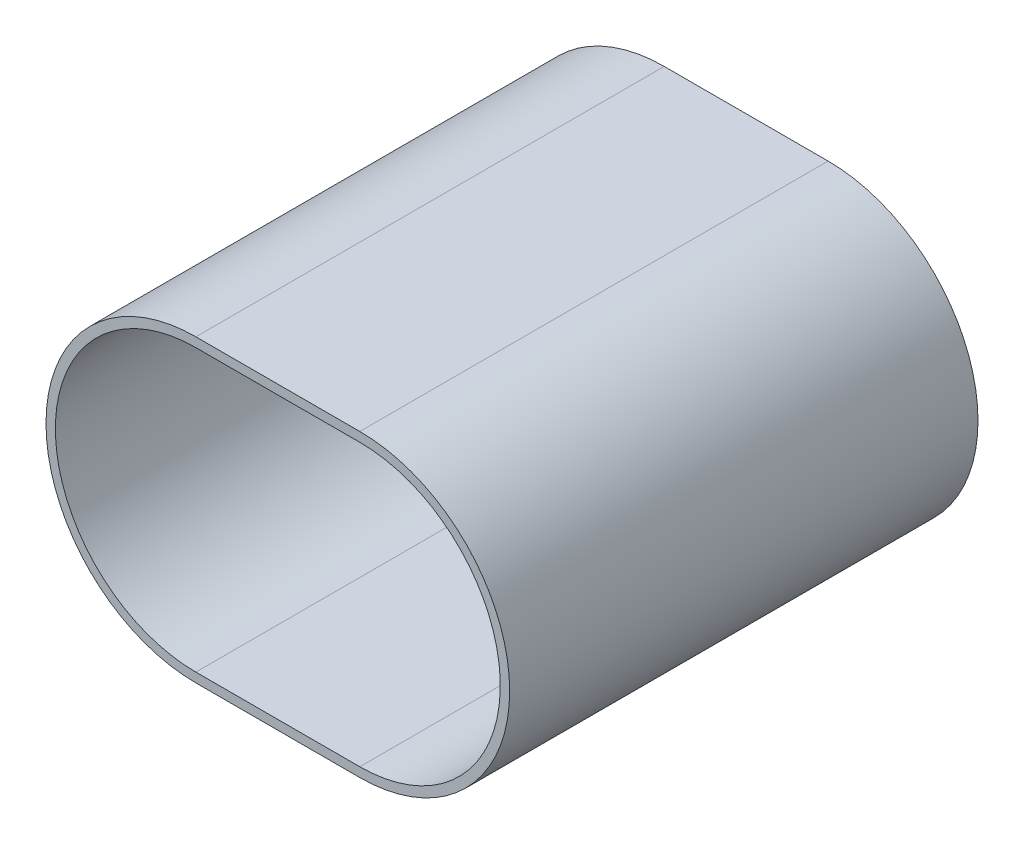
ISO-10303-21;
HEADER;
FILE_DESCRIPTION(('STEP AP214'),'2;1');
FILE_NAME('part.step','',(''),(''),'','','');
FILE_SCHEMA(('AUTOMOTIVE_DESIGN { 1 0 10303 214 1 1 1 1 }'));
ENDSEC;
DATA;
#1=APPLICATION_CONTEXT('core data for automotive mechanical design processes');
#2=APPLICATION_PROTOCOL_DEFINITION('international standard','automotive_design',2000,#1);
#3=PRODUCT_CONTEXT('',#1,'mechanical');
#4=PRODUCT('Part','Part','',(#3));
#5=PRODUCT_RELATED_PRODUCT_CATEGORY('part','',(#4));
#6=PRODUCT_DEFINITION_FORMATION('','',#4);
#7=PRODUCT_DEFINITION_CONTEXT('part definition',#1,'design');
#8=PRODUCT_DEFINITION('design','',#6,#7);
#9=PRODUCT_DEFINITION_SHAPE('','',#8);
#10=(LENGTH_UNIT() NAMED_UNIT(*) SI_UNIT(.MILLI.,.METRE.));
#11=(NAMED_UNIT(*) PLANE_ANGLE_UNIT() SI_UNIT($,.RADIAN.));
#12=(NAMED_UNIT(*) SI_UNIT($,.STERADIAN.) SOLID_ANGLE_UNIT());
#13=UNCERTAINTY_MEASURE_WITH_UNIT(LENGTH_MEASURE(1.E-05),#10,'distance_accuracy_value','');
#14=(GEOMETRIC_REPRESENTATION_CONTEXT(3) GLOBAL_UNCERTAINTY_ASSIGNED_CONTEXT((#13)) GLOBAL_UNIT_ASSIGNED_CONTEXT((#10,
#11,#12)) REPRESENTATION_CONTEXT('',''));
#15=CARTESIAN_POINT('',(0.,0.,0.));
#16=DIRECTION('',(0.,0.,1.));
#17=DIRECTION('',(1.,0.,0.));
#18=AXIS2_PLACEMENT_3D('',#15,#16,#17);
#19=CARTESIAN_POINT('',(0.,0.,100.));
#20=DIRECTION('',(0.,0.,1.));
#21=DIRECTION('',(1.,0.,0.));
#22=AXIS2_PLACEMENT_3D('',#19,#20,#21);
#23=PLANE('',#22);
#24=CARTESIAN_POINT('',(0.,0.,100.));
#25=DIRECTION('',(0.,0.,1.));
#26=DIRECTION('',(1.,0.,0.));
#27=AXIS2_PLACEMENT_3D('',#24,#25,#26);
#28=CIRCLE('',#27,32.);
#29=CARTESIAN_POINT('',(0.,32.,100.));
#30=VERTEX_POINT('',#29);
#31=CARTESIAN_POINT('',(0.,-32.,100.));
#32=VERTEX_POINT('',#31);
#33=EDGE_CURVE('E134',#30,#32,#28,.T.);
#34=ORIENTED_EDGE('',*,*,#33,.T.);
#35=DIRECTION('',(1.,0.,0.));
#36=VECTOR('',#35,1.);
#37=CARTESIAN_POINT('',(0.,-32.,100.));
#38=LINE('',#37,#36);
#39=CARTESIAN_POINT('',(35.,-32.,100.));
#40=VERTEX_POINT('',#39);
#41=EDGE_CURVE('E137',#32,#40,#38,.T.);
#42=ORIENTED_EDGE('',*,*,#41,.T.);
#43=CARTESIAN_POINT('',(35.,0.,100.));
#44=DIRECTION('',(0.,0.,1.));
#45=DIRECTION('',(1.,0.,0.));
#46=AXIS2_PLACEMENT_3D('',#43,#44,#45);
#47=CIRCLE('',#46,32.);
#48=CARTESIAN_POINT('',(35.,32.,100.));
#49=VERTEX_POINT('',#48);
#50=EDGE_CURVE('E140',#40,#49,#47,.T.);
#51=ORIENTED_EDGE('',*,*,#50,.T.);
#52=DIRECTION('',(-1.,0.,0.));
#53=VECTOR('',#52,1.);
#54=CARTESIAN_POINT('',(0.,32.,100.));
#55=LINE('',#54,#53);
#56=EDGE_CURVE('E142',#49,#30,#55,.T.);
#57=ORIENTED_EDGE('',*,*,#56,.T.);
#58=EDGE_LOOP('',(#34,#42,#51,#57));
#59=FACE_BOUND('',#58,.T.);
#60=DIRECTION('',(1.,0.,0.));
#61=VECTOR('',#60,1.);
#62=CARTESIAN_POINT('',(0.,-30.,100.));
#63=LINE('',#62,#61);
#64=CARTESIAN_POINT('',(0.,-30.,100.));
#65=VERTEX_POINT('',#64);
#66=CARTESIAN_POINT('',(35.,-30.,100.));
#67=VERTEX_POINT('',#66);
#68=EDGE_CURVE('E106',#65,#67,#63,.T.);
#69=ORIENTED_EDGE('',*,*,#68,.F.);
#70=CARTESIAN_POINT('',(0.,0.,100.));
#71=DIRECTION('',(0.,0.,1.));
#72=DIRECTION('',(1.,0.,0.));
#73=AXIS2_PLACEMENT_3D('',#70,#71,#72);
#74=CIRCLE('',#73,30.);
#75=CARTESIAN_POINT('',(0.,30.,100.));
#76=VERTEX_POINT('',#75);
#77=EDGE_CURVE('E98',#76,#65,#74,.T.);
#78=ORIENTED_EDGE('',*,*,#77,.F.);
#79=DIRECTION('',(-1.,0.,0.));
#80=VECTOR('',#79,1.);
#81=CARTESIAN_POINT('',(0.,30.,100.));
#82=LINE('',#81,#80);
#83=CARTESIAN_POINT('',(35.,30.,100.));
#84=VERTEX_POINT('',#83);
#85=EDGE_CURVE('E120',#84,#76,#82,.T.);
#86=ORIENTED_EDGE('',*,*,#85,.F.);
#87=CARTESIAN_POINT('',(35.,0.,100.));
#88=DIRECTION('',(0.,0.,1.));
#89=DIRECTION('',(1.,0.,0.));
#90=AXIS2_PLACEMENT_3D('',#87,#88,#89);
#91=CIRCLE('',#90,30.);
#92=EDGE_CURVE('E118',#67,#84,#91,.T.);
#93=ORIENTED_EDGE('',*,*,#92,.F.);
#94=EDGE_LOOP('',(#69,#78,#86,#93));
#95=FACE_BOUND('',#94,.T.);
#96=ADVANCED_FACE('F33',(#59,#95),#23,.T.);
#97=CARTESIAN_POINT('',(0.,0.,0.));
#98=DIRECTION('',(0.,0.,1.));
#99=DIRECTION('',(1.,0.,0.));
#100=AXIS2_PLACEMENT_3D('',#97,#98,#99);
#101=PLANE('',#100);
#102=CARTESIAN_POINT('',(0.,0.,0.));
#103=DIRECTION('',(0.,0.,1.));
#104=DIRECTION('',(1.,0.,0.));
#105=AXIS2_PLACEMENT_3D('',#102,#103,#104);
#106=CIRCLE('',#105,32.);
#107=CARTESIAN_POINT('',(0.,32.,0.));
#108=VERTEX_POINT('',#107);
#109=CARTESIAN_POINT('',(0.,-32.,0.));
#110=VERTEX_POINT('',#109);
#111=EDGE_CURVE('E114',#108,#110,#106,.T.);
#112=ORIENTED_EDGE('',*,*,#111,.F.);
#113=DIRECTION('',(-1.,0.,0.));
#114=VECTOR('',#113,1.);
#115=CARTESIAN_POINT('',(0.,32.,0.));
#116=LINE('',#115,#114);
#117=CARTESIAN_POINT('',(35.,32.,0.));
#118=VERTEX_POINT('',#117);
#119=EDGE_CURVE('E138',#118,#108,#116,.T.);
#120=ORIENTED_EDGE('',*,*,#119,.F.);
#121=CARTESIAN_POINT('',(35.,0.,0.));
#122=DIRECTION('',(0.,0.,1.));
#123=DIRECTION('',(1.,0.,0.));
#124=AXIS2_PLACEMENT_3D('',#121,#122,#123);
#125=CIRCLE('',#124,32.);
#126=CARTESIAN_POINT('',(35.,-32.,0.));
#127=VERTEX_POINT('',#126);
#128=EDGE_CURVE('E149',#127,#118,#125,.T.);
#129=ORIENTED_EDGE('',*,*,#128,.F.);
#130=DIRECTION('',(1.,0.,0.));
#131=VECTOR('',#130,1.);
#132=CARTESIAN_POINT('',(0.,-32.,0.));
#133=LINE('',#132,#131);
#134=EDGE_CURVE('E147',#110,#127,#133,.T.);
#135=ORIENTED_EDGE('',*,*,#134,.F.);
#136=EDGE_LOOP('',(#112,#120,#129,#135));
#137=FACE_BOUND('',#136,.T.);
#138=CARTESIAN_POINT('',(0.,0.,0.));
#139=DIRECTION('',(0.,0.,1.));
#140=DIRECTION('',(1.,0.,0.));
#141=AXIS2_PLACEMENT_3D('',#138,#139,#140);
#142=CIRCLE('',#141,30.);
#143=CARTESIAN_POINT('',(0.,30.,0.));
#144=VERTEX_POINT('',#143);
#145=CARTESIAN_POINT('',(0.,-30.,0.));
#146=VERTEX_POINT('',#145);
#147=EDGE_CURVE('E56',#144,#146,#142,.T.);
#148=ORIENTED_EDGE('',*,*,#147,.T.);
#149=DIRECTION('',(1.,0.,0.));
#150=VECTOR('',#149,1.);
#151=CARTESIAN_POINT('',(0.,-30.,0.));
#152=LINE('',#151,#150);
#153=CARTESIAN_POINT('',(35.,-30.,0.));
#154=VERTEX_POINT('',#153);
#155=EDGE_CURVE('E113',#146,#154,#152,.T.);
#156=ORIENTED_EDGE('',*,*,#155,.T.);
#157=CARTESIAN_POINT('',(35.,0.,0.));
#158=DIRECTION('',(0.,0.,1.));
#159=DIRECTION('',(1.,0.,0.));
#160=AXIS2_PLACEMENT_3D('',#157,#158,#159);
#161=CIRCLE('',#160,30.);
#162=CARTESIAN_POINT('',(35.,30.,0.));
#163=VERTEX_POINT('',#162);
#164=EDGE_CURVE('E126',#154,#163,#161,.T.);
#165=ORIENTED_EDGE('',*,*,#164,.T.);
#166=DIRECTION('',(-1.,0.,0.));
#167=VECTOR('',#166,1.);
#168=CARTESIAN_POINT('',(0.,30.,0.));
#169=LINE('',#168,#167);
#170=EDGE_CURVE('E107',#163,#144,#169,.T.);
#171=ORIENTED_EDGE('',*,*,#170,.T.);
#172=EDGE_LOOP('',(#148,#156,#165,#171));
#173=FACE_BOUND('',#172,.T.);
#174=ADVANCED_FACE('F167',(#137,#173),#101,.F.);
#175=CARTESIAN_POINT('',(0.,0.,100.));
#176=DIRECTION('',(0.,0.,-1.));
#177=DIRECTION('',(-1.,0.,0.));
#178=AXIS2_PLACEMENT_3D('',#175,#176,#177);
#179=CYLINDRICAL_SURFACE('',#178,32.);
#180=ORIENTED_EDGE('',*,*,#111,.T.);
#181=DIRECTION('',(0.,0.,-1.));
#182=VECTOR('',#181,1.);
#183=CARTESIAN_POINT('',(0.,-32.,100.));
#184=LINE('',#183,#182);
#185=EDGE_CURVE('E11',#32,#110,#184,.T.);
#186=ORIENTED_EDGE('',*,*,#185,.F.);
#187=ORIENTED_EDGE('',*,*,#33,.F.);
#188=DIRECTION('',(0.,0.,-1.));
#189=VECTOR('',#188,1.);
#190=CARTESIAN_POINT('',(0.,32.,100.));
#191=LINE('',#190,#189);
#192=EDGE_CURVE('E144',#30,#108,#191,.T.);
#193=ORIENTED_EDGE('',*,*,#192,.T.);
#194=EDGE_LOOP('',(#180,#186,#187,#193));
#195=FACE_BOUND('',#194,.T.);
#196=ADVANCED_FACE('F35',(#195),#179,.T.);
#197=CARTESIAN_POINT('',(0.,-32.,100.));
#198=DIRECTION('',(0.,1.,0.));
#199=DIRECTION('',(0.,0.,1.));
#200=AXIS2_PLACEMENT_3D('',#197,#198,#199);
#201=PLANE('',#200);
#202=ORIENTED_EDGE('',*,*,#134,.T.);
#203=DIRECTION('',(0.,0.,-1.));
#204=VECTOR('',#203,1.);
#205=CARTESIAN_POINT('',(35.,-32.,100.));
#206=LINE('',#205,#204);
#207=EDGE_CURVE('E41',#40,#127,#206,.T.);
#208=ORIENTED_EDGE('',*,*,#207,.F.);
#209=ORIENTED_EDGE('',*,*,#41,.F.);
#210=ORIENTED_EDGE('',*,*,#185,.T.);
#211=EDGE_LOOP('',(#202,#208,#209,#210));
#212=FACE_BOUND('',#211,.T.);
#213=ADVANCED_FACE('F177',(#212),#201,.F.);
#214=CARTESIAN_POINT('',(35.,0.,100.));
#215=DIRECTION('',(0.,0.,-1.));
#216=DIRECTION('',(-1.,0.,0.));
#217=AXIS2_PLACEMENT_3D('',#214,#215,#216);
#218=CYLINDRICAL_SURFACE('',#217,32.);
#219=ORIENTED_EDGE('',*,*,#128,.T.);
#220=DIRECTION('',(0.,0.,-1.));
#221=VECTOR('',#220,1.);
#222=CARTESIAN_POINT('',(35.,32.,100.));
#223=LINE('',#222,#221);
#224=EDGE_CURVE('E154',#49,#118,#223,.T.);
#225=ORIENTED_EDGE('',*,*,#224,.F.);
#226=ORIENTED_EDGE('',*,*,#50,.F.);
#227=ORIENTED_EDGE('',*,*,#207,.T.);
#228=EDGE_LOOP('',(#219,#225,#226,#227));
#229=FACE_BOUND('',#228,.T.);
#230=ADVANCED_FACE('F161',(#229),#218,.T.);
#231=CARTESIAN_POINT('',(0.,32.,100.));
#232=DIRECTION('',(0.,-1.,0.));
#233=DIRECTION('',(0.,0.,-1.));
#234=AXIS2_PLACEMENT_3D('',#231,#232,#233);
#235=PLANE('',#234);
#236=ORIENTED_EDGE('',*,*,#119,.T.);
#237=ORIENTED_EDGE('',*,*,#192,.F.);
#238=ORIENTED_EDGE('',*,*,#56,.F.);
#239=ORIENTED_EDGE('',*,*,#224,.T.);
#240=EDGE_LOOP('',(#236,#237,#238,#239));
#241=FACE_BOUND('',#240,.T.);
#242=ADVANCED_FACE('F171',(#241),#235,.F.);
#243=CARTESIAN_POINT('',(0.,0.,100.));
#244=DIRECTION('',(0.,0.,-1.));
#245=DIRECTION('',(-1.,0.,0.));
#246=AXIS2_PLACEMENT_3D('',#243,#244,#245);
#247=CYLINDRICAL_SURFACE('',#246,30.);
#248=ORIENTED_EDGE('',*,*,#147,.F.);
#249=DIRECTION('',(0.,0.,-1.));
#250=VECTOR('',#249,1.);
#251=CARTESIAN_POINT('',(0.,30.,100.));
#252=LINE('',#251,#250);
#253=EDGE_CURVE('E102',#76,#144,#252,.T.);
#254=ORIENTED_EDGE('',*,*,#253,.F.);
#255=ORIENTED_EDGE('',*,*,#77,.T.);
#256=DIRECTION('',(0.,0.,-1.));
#257=VECTOR('',#256,1.);
#258=CARTESIAN_POINT('',(0.,-30.,100.));
#259=LINE('',#258,#257);
#260=EDGE_CURVE('E101',#65,#146,#259,.T.);
#261=ORIENTED_EDGE('',*,*,#260,.T.);
#262=EDGE_LOOP('',(#248,#254,#255,#261));
#263=FACE_BOUND('',#262,.T.);
#264=ADVANCED_FACE('F100',(#263),#247,.F.);
#265=CARTESIAN_POINT('',(0.,-30.,100.));
#266=DIRECTION('',(0.,1.,0.));
#267=DIRECTION('',(0.,0.,1.));
#268=AXIS2_PLACEMENT_3D('',#265,#266,#267);
#269=PLANE('',#268);
#270=ORIENTED_EDGE('',*,*,#155,.F.);
#271=ORIENTED_EDGE('',*,*,#260,.F.);
#272=ORIENTED_EDGE('',*,*,#68,.T.);
#273=DIRECTION('',(0.,0.,-1.));
#274=VECTOR('',#273,1.);
#275=CARTESIAN_POINT('',(35.,-30.,100.));
#276=LINE('',#275,#274);
#277=EDGE_CURVE('E115',#67,#154,#276,.T.);
#278=ORIENTED_EDGE('',*,*,#277,.T.);
#279=EDGE_LOOP('',(#270,#271,#272,#278));
#280=FACE_BOUND('',#279,.T.);
#281=ADVANCED_FACE('F110',(#280),#269,.T.);
#282=CARTESIAN_POINT('',(35.,0.,100.));
#283=DIRECTION('',(0.,0.,-1.));
#284=DIRECTION('',(-1.,0.,0.));
#285=AXIS2_PLACEMENT_3D('',#282,#283,#284);
#286=CYLINDRICAL_SURFACE('',#285,30.);
#287=ORIENTED_EDGE('',*,*,#164,.F.);
#288=ORIENTED_EDGE('',*,*,#277,.F.);
#289=ORIENTED_EDGE('',*,*,#92,.T.);
#290=DIRECTION('',(0.,0.,-1.));
#291=VECTOR('',#290,1.);
#292=CARTESIAN_POINT('',(35.,30.,100.));
#293=LINE('',#292,#291);
#294=EDGE_CURVE('E48',#84,#163,#293,.T.);
#295=ORIENTED_EDGE('',*,*,#294,.T.);
#296=EDGE_LOOP('',(#287,#288,#289,#295));
#297=FACE_BOUND('',#296,.T.);
#298=ADVANCED_FACE('F200',(#297),#286,.F.);
#299=CARTESIAN_POINT('',(0.,30.,100.));
#300=DIRECTION('',(0.,-1.,0.));
#301=DIRECTION('',(0.,0.,-1.));
#302=AXIS2_PLACEMENT_3D('',#299,#300,#301);
#303=PLANE('',#302);
#304=ORIENTED_EDGE('',*,*,#170,.F.);
#305=ORIENTED_EDGE('',*,*,#294,.F.);
#306=ORIENTED_EDGE('',*,*,#85,.T.);
#307=ORIENTED_EDGE('',*,*,#253,.T.);
#308=EDGE_LOOP('',(#304,#305,#306,#307));
#309=FACE_BOUND('',#308,.T.);
#310=ADVANCED_FACE('F204',(#309),#303,.T.);
#311=CLOSED_SHELL('',(#96,#174,#196,#213,#230,#242,#264,#281,#298,#310));
#312=MANIFOLD_SOLID_BREP('B2',#311);
#313=ADVANCED_BREP_SHAPE_REPRESENTATION('',(#18,#312),#14);
#314=SHAPE_DEFINITION_REPRESENTATION(#9,#313);
ENDSEC;
END-ISO-10303-21;
